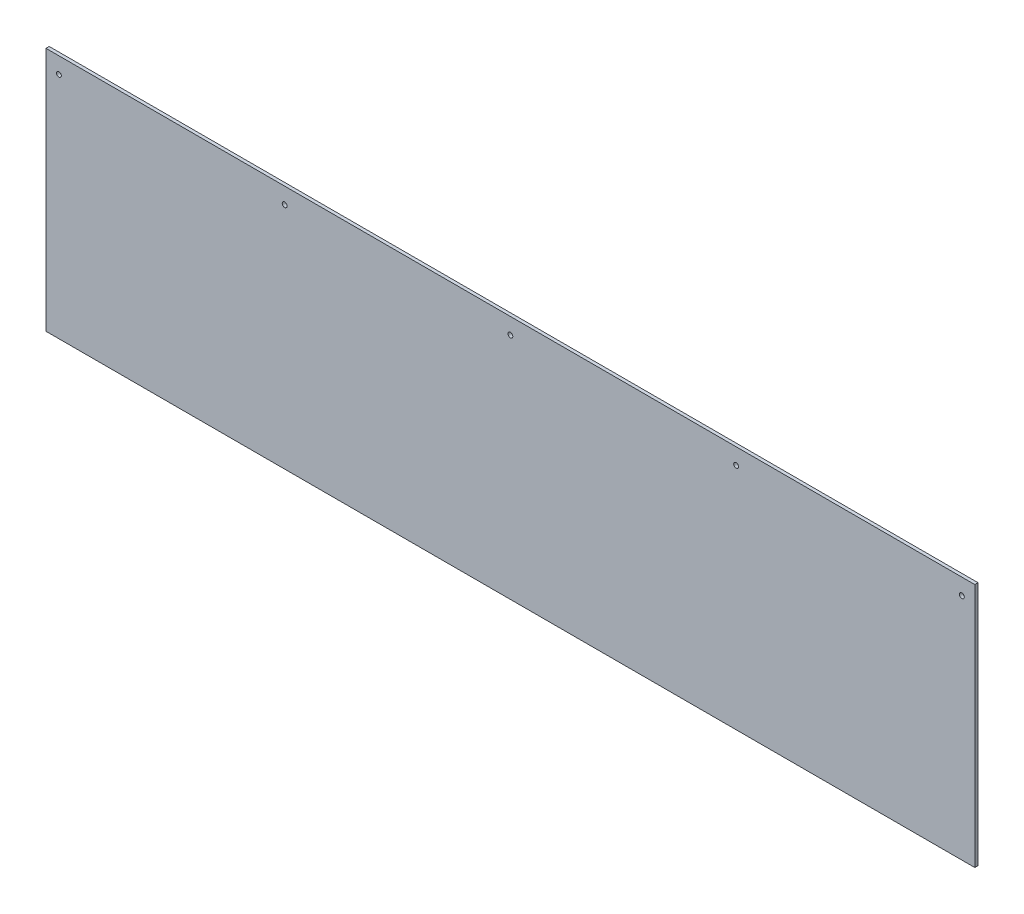
ISO-10303-21;
HEADER;
FILE_DESCRIPTION(('STEP AP214'),'2;1');
FILE_NAME('part.step','',(''),(''),'','','');
FILE_SCHEMA(('AUTOMOTIVE_DESIGN { 1 0 10303 214 1 1 1 1 }'));
ENDSEC;
DATA;
#1=APPLICATION_CONTEXT('core data for automotive mechanical design processes');
#2=APPLICATION_PROTOCOL_DEFINITION('international standard','automotive_design',2000,#1);
#3=PRODUCT_CONTEXT('',#1,'mechanical');
#4=PRODUCT('Part','Part','',(#3));
#5=PRODUCT_RELATED_PRODUCT_CATEGORY('part','',(#4));
#6=PRODUCT_DEFINITION_FORMATION('','',#4);
#7=PRODUCT_DEFINITION_CONTEXT('part definition',#1,'design');
#8=PRODUCT_DEFINITION('design','',#6,#7);
#9=PRODUCT_DEFINITION_SHAPE('','',#8);
#10=(LENGTH_UNIT() NAMED_UNIT(*) SI_UNIT(.MILLI.,.METRE.));
#11=(NAMED_UNIT(*) PLANE_ANGLE_UNIT() SI_UNIT($,.RADIAN.));
#12=(NAMED_UNIT(*) SI_UNIT($,.STERADIAN.) SOLID_ANGLE_UNIT());
#13=UNCERTAINTY_MEASURE_WITH_UNIT(LENGTH_MEASURE(1.E-05),#10,'distance_accuracy_value','');
#14=(GEOMETRIC_REPRESENTATION_CONTEXT(3) GLOBAL_UNCERTAINTY_ASSIGNED_CONTEXT((#13)) GLOBAL_UNIT_ASSIGNED_CONTEXT((#10,
#11,#12)) REPRESENTATION_CONTEXT('',''));
#15=CARTESIAN_POINT('',(0.,0.,0.));
#16=DIRECTION('',(0.,0.,1.));
#17=DIRECTION('',(1.,0.,0.));
#18=AXIS2_PLACEMENT_3D('',#15,#16,#17);
#19=CARTESIAN_POINT('',(0.,0.,6.35));
#20=DIRECTION('',(1.,0.,0.));
#21=DIRECTION('',(0.,0.,-1.));
#22=AXIS2_PLACEMENT_3D('',#19,#20,#21);
#23=PLANE('',#22);
#24=DIRECTION('',(0.,-1.,0.));
#25=VECTOR('',#24,1.);
#26=CARTESIAN_POINT('',(0.,0.,0.));
#27=LINE('',#26,#25);
#28=CARTESIAN_POINT('',(0.,482.6,0.));
#29=VERTEX_POINT('',#28);
#30=CARTESIAN_POINT('',(0.,0.,0.));
#31=VERTEX_POINT('',#30);
#32=EDGE_CURVE('E100',#29,#31,#27,.T.);
#33=ORIENTED_EDGE('',*,*,#32,.T.);
#34=DIRECTION('',(0.,0.,-1.));
#35=VECTOR('',#34,1.);
#36=CARTESIAN_POINT('',(0.,0.,6.35));
#37=LINE('',#36,#35);
#38=CARTESIAN_POINT('',(0.,0.,6.35));
#39=VERTEX_POINT('',#38);
#40=EDGE_CURVE('E11',#39,#31,#37,.T.);
#41=ORIENTED_EDGE('',*,*,#40,.F.);
#42=DIRECTION('',(0.,-1.,0.));
#43=VECTOR('',#42,1.);
#44=CARTESIAN_POINT('',(0.,0.,6.35));
#45=LINE('',#44,#43);
#46=CARTESIAN_POINT('',(0.,482.6,6.35));
#47=VERTEX_POINT('',#46);
#48=EDGE_CURVE('E88',#47,#39,#45,.T.);
#49=ORIENTED_EDGE('',*,*,#48,.F.);
#50=DIRECTION('',(0.,0.,-1.));
#51=VECTOR('',#50,1.);
#52=CARTESIAN_POINT('',(0.,482.6,6.35));
#53=LINE('',#52,#51);
#54=EDGE_CURVE('E96',#47,#29,#53,.T.);
#55=ORIENTED_EDGE('',*,*,#54,.T.);
#56=EDGE_LOOP('',(#33,#41,#49,#55));
#57=FACE_BOUND('',#56,.T.);
#58=ADVANCED_FACE('F37',(#57),#23,.F.);
#59=CARTESIAN_POINT('',(0.,0.,6.35));
#60=DIRECTION('',(0.,1.,0.));
#61=DIRECTION('',(0.,0.,1.));
#62=AXIS2_PLACEMENT_3D('',#59,#60,#61);
#63=PLANE('',#62);
#64=DIRECTION('',(1.,0.,0.));
#65=VECTOR('',#64,1.);
#66=CARTESIAN_POINT('',(0.,0.,0.));
#67=LINE('',#66,#65);
#68=CARTESIAN_POINT('',(1828.8,0.,0.));
#69=VERTEX_POINT('',#68);
#70=EDGE_CURVE('E92',#31,#69,#67,.T.);
#71=ORIENTED_EDGE('',*,*,#70,.T.);
#72=DIRECTION('',(0.,0.,-1.));
#73=VECTOR('',#72,1.);
#74=CARTESIAN_POINT('',(1828.8,0.,6.35));
#75=LINE('',#74,#73);
#76=CARTESIAN_POINT('',(1828.8,0.,6.35));
#77=VERTEX_POINT('',#76);
#78=EDGE_CURVE('E45',#77,#69,#75,.T.);
#79=ORIENTED_EDGE('',*,*,#78,.F.);
#80=DIRECTION('',(1.,0.,0.));
#81=VECTOR('',#80,1.);
#82=CARTESIAN_POINT('',(0.,0.,6.35));
#83=LINE('',#82,#81);
#84=EDGE_CURVE('E83',#39,#77,#83,.T.);
#85=ORIENTED_EDGE('',*,*,#84,.F.);
#86=ORIENTED_EDGE('',*,*,#40,.T.);
#87=EDGE_LOOP('',(#71,#79,#85,#86));
#88=FACE_BOUND('',#87,.T.);
#89=ADVANCED_FACE('F91',(#88),#63,.F.);
#90=CARTESIAN_POINT('',(1828.8,0.,6.35));
#91=DIRECTION('',(-1.,0.,0.));
#92=DIRECTION('',(0.,0.,1.));
#93=AXIS2_PLACEMENT_3D('',#90,#91,#92);
#94=PLANE('',#93);
#95=DIRECTION('',(0.,1.,0.));
#96=VECTOR('',#95,1.);
#97=CARTESIAN_POINT('',(1828.8,0.,0.));
#98=LINE('',#97,#96);
#99=CARTESIAN_POINT('',(1828.8,482.6,0.));
#100=VERTEX_POINT('',#99);
#101=EDGE_CURVE('E70',#69,#100,#98,.T.);
#102=ORIENTED_EDGE('',*,*,#101,.T.);
#103=DIRECTION('',(0.,0.,-1.));
#104=VECTOR('',#103,1.);
#105=CARTESIAN_POINT('',(1828.8,482.6,6.35));
#106=LINE('',#105,#104);
#107=CARTESIAN_POINT('',(1828.8,482.6,6.35));
#108=VERTEX_POINT('',#107);
#109=EDGE_CURVE('E93',#108,#100,#106,.T.);
#110=ORIENTED_EDGE('',*,*,#109,.F.);
#111=DIRECTION('',(0.,1.,0.));
#112=VECTOR('',#111,1.);
#113=CARTESIAN_POINT('',(1828.8,0.,6.35));
#114=LINE('',#113,#112);
#115=EDGE_CURVE('E86',#77,#108,#114,.T.);
#116=ORIENTED_EDGE('',*,*,#115,.F.);
#117=ORIENTED_EDGE('',*,*,#78,.T.);
#118=EDGE_LOOP('',(#102,#110,#116,#117));
#119=FACE_BOUND('',#118,.T.);
#120=ADVANCED_FACE('F94',(#119),#94,.F.);
#121=CARTESIAN_POINT('',(0.,482.6,6.35));
#122=DIRECTION('',(0.,-1.,0.));
#123=DIRECTION('',(1.,0.,0.));
#124=AXIS2_PLACEMENT_3D('',#121,#122,#123);
#125=PLANE('',#124);
#126=DIRECTION('',(-1.,0.,0.));
#127=VECTOR('',#126,1.);
#128=CARTESIAN_POINT('',(0.,482.6,0.));
#129=LINE('',#128,#127);
#130=EDGE_CURVE('E76',#100,#29,#129,.T.);
#131=ORIENTED_EDGE('',*,*,#130,.T.);
#132=ORIENTED_EDGE('',*,*,#54,.F.);
#133=DIRECTION('',(-1.,0.,0.));
#134=VECTOR('',#133,1.);
#135=CARTESIAN_POINT('',(0.,482.6,6.35));
#136=LINE('',#135,#134);
#137=EDGE_CURVE('E53',#108,#47,#136,.T.);
#138=ORIENTED_EDGE('',*,*,#137,.F.);
#139=ORIENTED_EDGE('',*,*,#109,.T.);
#140=EDGE_LOOP('',(#131,#132,#138,#139));
#141=FACE_BOUND('',#140,.T.);
#142=ADVANCED_FACE('F108',(#141),#125,.F.);
#143=CARTESIAN_POINT('',(0.,0.,6.35));
#144=DIRECTION('',(0.,0.,-1.));
#145=DIRECTION('',(-1.,0.,0.));
#146=AXIS2_PLACEMENT_3D('',#143,#144,#145);
#147=PLANE('',#146);
#148=CARTESIAN_POINT('',(25.4,450.85,6.35));
#149=DIRECTION('',(0.,0.,1.));
#150=DIRECTION('',(1.,0.,0.));
#151=AXIS2_PLACEMENT_3D('',#148,#149,#150);
#152=CIRCLE('',#151,4.7625);
#153=CARTESIAN_POINT('',(30.1625,450.85,6.35));
#154=VERTEX_POINT('',#153);
#155=EDGE_CURVE('E138',#154,#154,#152,.T.);
#156=ORIENTED_EDGE('',*,*,#155,.F.);
#157=EDGE_LOOP('',(#156));
#158=FACE_BOUND('',#157,.T.);
#159=CARTESIAN_POINT('',(469.9,450.85,6.35));
#160=DIRECTION('',(0.,0.,1.));
#161=DIRECTION('',(1.,0.,0.));
#162=AXIS2_PLACEMENT_3D('',#159,#160,#161);
#163=CIRCLE('',#162,4.76250000000001);
#164=CARTESIAN_POINT('',(474.6625,450.85,6.35));
#165=VERTEX_POINT('',#164);
#166=EDGE_CURVE('E132',#165,#165,#163,.T.);
#167=ORIENTED_EDGE('',*,*,#166,.F.);
#168=EDGE_LOOP('',(#167));
#169=FACE_BOUND('',#168,.T.);
#170=CARTESIAN_POINT('',(914.4,450.85,6.35));
#171=DIRECTION('',(0.,0.,1.));
#172=DIRECTION('',(1.,0.,0.));
#173=AXIS2_PLACEMENT_3D('',#170,#171,#172);
#174=CIRCLE('',#173,4.76250000000001);
#175=CARTESIAN_POINT('',(919.1625,450.85,6.35));
#176=VERTEX_POINT('',#175);
#177=EDGE_CURVE('E126',#176,#176,#174,.T.);
#178=ORIENTED_EDGE('',*,*,#177,.F.);
#179=EDGE_LOOP('',(#178));
#180=FACE_BOUND('',#179,.T.);
#181=CARTESIAN_POINT('',(1358.9,450.85,6.35));
#182=DIRECTION('',(0.,0.,1.));
#183=DIRECTION('',(1.,0.,0.));
#184=AXIS2_PLACEMENT_3D('',#181,#182,#183);
#185=CIRCLE('',#184,4.7624999999999);
#186=CARTESIAN_POINT('',(1363.6625,450.85,6.35));
#187=VERTEX_POINT('',#186);
#188=EDGE_CURVE('E120',#187,#187,#185,.T.);
#189=ORIENTED_EDGE('',*,*,#188,.F.);
#190=EDGE_LOOP('',(#189));
#191=FACE_BOUND('',#190,.T.);
#192=CARTESIAN_POINT('',(1803.4,450.85,6.35));
#193=DIRECTION('',(0.,0.,1.));
#194=DIRECTION('',(1.,0.,0.));
#195=AXIS2_PLACEMENT_3D('',#192,#193,#194);
#196=CIRCLE('',#195,4.7624999999999);
#197=CARTESIAN_POINT('',(1808.1625,450.85,6.35));
#198=VERTEX_POINT('',#197);
#199=EDGE_CURVE('E114',#198,#198,#196,.T.);
#200=ORIENTED_EDGE('',*,*,#199,.F.);
#201=EDGE_LOOP('',(#200));
#202=FACE_BOUND('',#201,.T.);
#203=ORIENTED_EDGE('',*,*,#48,.T.);
#204=ORIENTED_EDGE('',*,*,#84,.T.);
#205=ORIENTED_EDGE('',*,*,#115,.T.);
#206=ORIENTED_EDGE('',*,*,#137,.T.);
#207=EDGE_LOOP('',(#203,#204,#205,#206));
#208=FACE_BOUND('',#207,.T.);
#209=ADVANCED_FACE('F84',(#158,#169,#180,#191,#202,#208),#147,.F.);
#210=CARTESIAN_POINT('',(0.,0.,0.));
#211=DIRECTION('',(0.,0.,-1.));
#212=DIRECTION('',(-1.,0.,0.));
#213=AXIS2_PLACEMENT_3D('',#210,#211,#212);
#214=PLANE('',#213);
#215=CARTESIAN_POINT('',(25.4,450.85,0.));
#216=DIRECTION('',(0.,0.,1.));
#217=DIRECTION('',(1.,0.,0.));
#218=AXIS2_PLACEMENT_3D('',#215,#216,#217);
#219=CIRCLE('',#218,4.7625);
#220=CARTESIAN_POINT('',(30.1625,450.85,0.));
#221=VERTEX_POINT('',#220);
#222=EDGE_CURVE('E103',#221,#221,#219,.T.);
#223=ORIENTED_EDGE('',*,*,#222,.T.);
#224=EDGE_LOOP('',(#223));
#225=FACE_BOUND('',#224,.T.);
#226=CARTESIAN_POINT('',(469.9,450.85,0.));
#227=DIRECTION('',(0.,0.,1.));
#228=DIRECTION('',(1.,0.,0.));
#229=AXIS2_PLACEMENT_3D('',#226,#227,#228);
#230=CIRCLE('',#229,4.76250000000001);
#231=CARTESIAN_POINT('',(474.6625,450.85,0.));
#232=VERTEX_POINT('',#231);
#233=EDGE_CURVE('E135',#232,#232,#230,.T.);
#234=ORIENTED_EDGE('',*,*,#233,.T.);
#235=EDGE_LOOP('',(#234));
#236=FACE_BOUND('',#235,.T.);
#237=CARTESIAN_POINT('',(914.4,450.85,0.));
#238=DIRECTION('',(0.,0.,1.));
#239=DIRECTION('',(1.,0.,0.));
#240=AXIS2_PLACEMENT_3D('',#237,#238,#239);
#241=CIRCLE('',#240,4.76250000000001);
#242=CARTESIAN_POINT('',(919.1625,450.85,0.));
#243=VERTEX_POINT('',#242);
#244=EDGE_CURVE('E129',#243,#243,#241,.T.);
#245=ORIENTED_EDGE('',*,*,#244,.T.);
#246=EDGE_LOOP('',(#245));
#247=FACE_BOUND('',#246,.T.);
#248=CARTESIAN_POINT('',(1358.9,450.85,0.));
#249=DIRECTION('',(0.,0.,1.));
#250=DIRECTION('',(1.,0.,0.));
#251=AXIS2_PLACEMENT_3D('',#248,#249,#250);
#252=CIRCLE('',#251,4.7624999999999);
#253=CARTESIAN_POINT('',(1363.6625,450.85,0.));
#254=VERTEX_POINT('',#253);
#255=EDGE_CURVE('E123',#254,#254,#252,.T.);
#256=ORIENTED_EDGE('',*,*,#255,.T.);
#257=EDGE_LOOP('',(#256));
#258=FACE_BOUND('',#257,.T.);
#259=CARTESIAN_POINT('',(1803.4,450.85,0.));
#260=DIRECTION('',(0.,0.,1.));
#261=DIRECTION('',(1.,0.,0.));
#262=AXIS2_PLACEMENT_3D('',#259,#260,#261);
#263=CIRCLE('',#262,4.7624999999999);
#264=CARTESIAN_POINT('',(1808.1625,450.85,0.));
#265=VERTEX_POINT('',#264);
#266=EDGE_CURVE('E117',#265,#265,#263,.T.);
#267=ORIENTED_EDGE('',*,*,#266,.T.);
#268=EDGE_LOOP('',(#267));
#269=FACE_BOUND('',#268,.T.);
#270=ORIENTED_EDGE('',*,*,#32,.F.);
#271=ORIENTED_EDGE('',*,*,#130,.F.);
#272=ORIENTED_EDGE('',*,*,#101,.F.);
#273=ORIENTED_EDGE('',*,*,#70,.F.);
#274=EDGE_LOOP('',(#270,#271,#272,#273));
#275=FACE_BOUND('',#274,.T.);
#276=ADVANCED_FACE('F111',(#225,#236,#247,#258,#269,#275),#214,.T.);
#277=CARTESIAN_POINT('',(1803.4,450.85,0.));
#278=DIRECTION('',(0.,0.,1.));
#279=DIRECTION('',(1.,0.,0.));
#280=AXIS2_PLACEMENT_3D('',#277,#278,#279);
#281=CYLINDRICAL_SURFACE('',#280,4.7624999999999);
#282=ORIENTED_EDGE('',*,*,#266,.F.);
#283=EDGE_LOOP('',(#282));
#284=FACE_BOUND('',#283,.T.);
#285=ORIENTED_EDGE('',*,*,#199,.T.);
#286=EDGE_LOOP('',(#285));
#287=FACE_BOUND('',#286,.T.);
#288=ADVANCED_FACE('F164',(#284,#287),#281,.F.);
#289=CARTESIAN_POINT('',(1358.9,450.85,0.));
#290=DIRECTION('',(0.,0.,1.));
#291=DIRECTION('',(1.,0.,0.));
#292=AXIS2_PLACEMENT_3D('',#289,#290,#291);
#293=CYLINDRICAL_SURFACE('',#292,4.7624999999999);
#294=ORIENTED_EDGE('',*,*,#255,.F.);
#295=EDGE_LOOP('',(#294));
#296=FACE_BOUND('',#295,.T.);
#297=ORIENTED_EDGE('',*,*,#188,.T.);
#298=EDGE_LOOP('',(#297));
#299=FACE_BOUND('',#298,.T.);
#300=ADVANCED_FACE('F166',(#296,#299),#293,.F.);
#301=CARTESIAN_POINT('',(914.4,450.85,0.));
#302=DIRECTION('',(0.,0.,1.));
#303=DIRECTION('',(1.,0.,0.));
#304=AXIS2_PLACEMENT_3D('',#301,#302,#303);
#305=CYLINDRICAL_SURFACE('',#304,4.76250000000001);
#306=ORIENTED_EDGE('',*,*,#244,.F.);
#307=EDGE_LOOP('',(#306));
#308=FACE_BOUND('',#307,.T.);
#309=ORIENTED_EDGE('',*,*,#177,.T.);
#310=EDGE_LOOP('',(#309));
#311=FACE_BOUND('',#310,.T.);
#312=ADVANCED_FACE('F173',(#308,#311),#305,.F.);
#313=CARTESIAN_POINT('',(469.9,450.85,0.));
#314=DIRECTION('',(0.,0.,1.));
#315=DIRECTION('',(1.,0.,0.));
#316=AXIS2_PLACEMENT_3D('',#313,#314,#315);
#317=CYLINDRICAL_SURFACE('',#316,4.76250000000001);
#318=ORIENTED_EDGE('',*,*,#233,.F.);
#319=EDGE_LOOP('',(#318));
#320=FACE_BOUND('',#319,.T.);
#321=ORIENTED_EDGE('',*,*,#166,.T.);
#322=EDGE_LOOP('',(#321));
#323=FACE_BOUND('',#322,.T.);
#324=ADVANCED_FACE('F149',(#320,#323),#317,.F.);
#325=CARTESIAN_POINT('',(25.4,450.85,0.));
#326=DIRECTION('',(0.,0.,1.));
#327=DIRECTION('',(1.,0.,0.));
#328=AXIS2_PLACEMENT_3D('',#325,#326,#327);
#329=CYLINDRICAL_SURFACE('',#328,4.7625);
#330=ORIENTED_EDGE('',*,*,#222,.F.);
#331=EDGE_LOOP('',(#330));
#332=FACE_BOUND('',#331,.T.);
#333=ORIENTED_EDGE('',*,*,#155,.T.);
#334=EDGE_LOOP('',(#333));
#335=FACE_BOUND('',#334,.T.);
#336=ADVANCED_FACE('F146',(#332,#335),#329,.F.);
#337=CLOSED_SHELL('',(#58,#89,#120,#142,#209,#276,#288,#300,#312,#324,#336));
#338=MANIFOLD_SOLID_BREP('B2',#337);
#339=ADVANCED_BREP_SHAPE_REPRESENTATION('',(#18,#338),#14);
#340=SHAPE_DEFINITION_REPRESENTATION(#9,#339);
ENDSEC;
END-ISO-10303-21;
